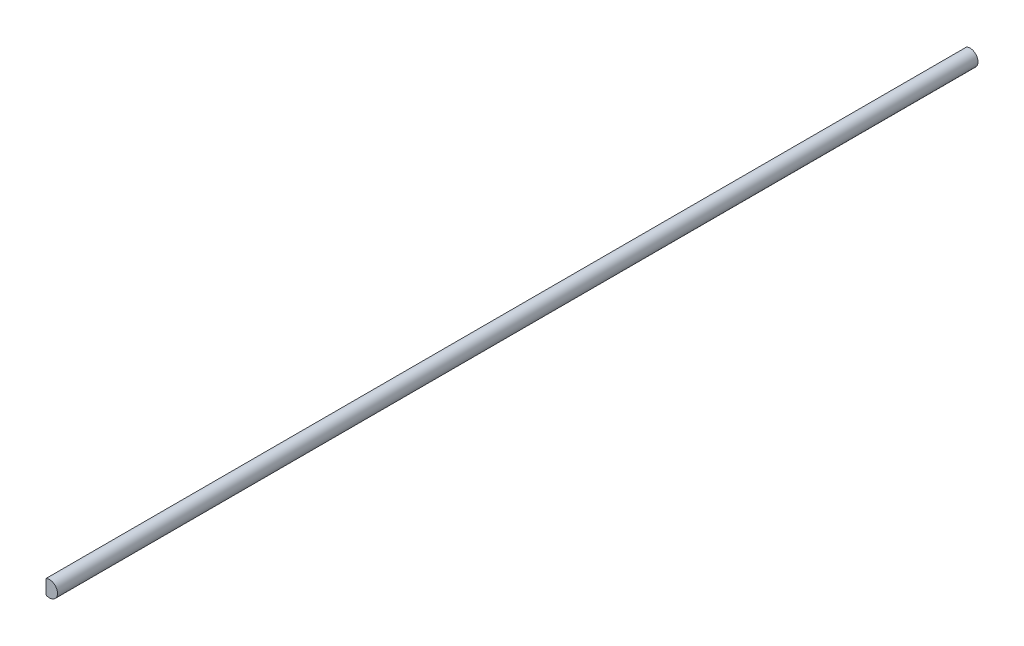
ISO-10303-21;
HEADER;
FILE_DESCRIPTION(('STEP AP214'),'2;1');
FILE_NAME('part.step','',(''),(''),'','','');
FILE_SCHEMA(('AUTOMOTIVE_DESIGN { 1 0 10303 214 1 1 1 1 }'));
ENDSEC;
DATA;
#1=APPLICATION_CONTEXT('core data for automotive mechanical design processes');
#2=APPLICATION_PROTOCOL_DEFINITION('international standard','automotive_design',2000,#1);
#3=PRODUCT_CONTEXT('',#1,'mechanical');
#4=PRODUCT('Part','Part','',(#3));
#5=PRODUCT_RELATED_PRODUCT_CATEGORY('part','',(#4));
#6=PRODUCT_DEFINITION_FORMATION('','',#4);
#7=PRODUCT_DEFINITION_CONTEXT('part definition',#1,'design');
#8=PRODUCT_DEFINITION('design','',#6,#7);
#9=PRODUCT_DEFINITION_SHAPE('','',#8);
#10=(LENGTH_UNIT() NAMED_UNIT(*) SI_UNIT(.MILLI.,.METRE.));
#11=(NAMED_UNIT(*) PLANE_ANGLE_UNIT() SI_UNIT($,.RADIAN.));
#12=(NAMED_UNIT(*) SI_UNIT($,.STERADIAN.) SOLID_ANGLE_UNIT());
#13=UNCERTAINTY_MEASURE_WITH_UNIT(LENGTH_MEASURE(1.E-05),#10,'distance_accuracy_value','');
#14=(GEOMETRIC_REPRESENTATION_CONTEXT(3) GLOBAL_UNCERTAINTY_ASSIGNED_CONTEXT((#13)) GLOBAL_UNIT_ASSIGNED_CONTEXT((#10,
#11,#12)) REPRESENTATION_CONTEXT('',''));
#15=CARTESIAN_POINT('',(0.,0.,0.));
#16=DIRECTION('',(0.,0.,1.));
#17=DIRECTION('',(1.,0.,0.));
#18=AXIS2_PLACEMENT_3D('',#15,#16,#17);
#19=CARTESIAN_POINT('',(0.,0.,130.));
#20=DIRECTION('',(0.,0.,-1.));
#21=DIRECTION('',(-1.,0.,0.));
#22=AXIS2_PLACEMENT_3D('',#19,#20,#21);
#23=CYLINDRICAL_SURFACE('',#22,2.25);
#24=CARTESIAN_POINT('',(0.,0.,-130.));
#25=DIRECTION('',(0.,0.,1.));
#26=DIRECTION('',(1.,0.,0.));
#27=AXIS2_PLACEMENT_3D('',#24,#25,#26);
#28=CIRCLE('',#27,2.25);
#29=CARTESIAN_POINT('',(-0.99,-2.02049498885793,-130.));
#30=VERTEX_POINT('',#29);
#31=CARTESIAN_POINT('',(-0.99,2.02049498885793,-130.));
#32=VERTEX_POINT('',#31);
#33=EDGE_CURVE('E69',#30,#32,#28,.T.);
#34=ORIENTED_EDGE('',*,*,#33,.T.);
#35=DIRECTION('',(0.,0.,-1.));
#36=VECTOR('',#35,1.);
#37=CARTESIAN_POINT('',(-0.99,2.02049498885793,130.));
#38=LINE('',#37,#36);
#39=CARTESIAN_POINT('',(-0.99,2.02049498885793,130.));
#40=VERTEX_POINT('',#39);
#41=EDGE_CURVE('E11',#40,#32,#38,.T.);
#42=ORIENTED_EDGE('',*,*,#41,.F.);
#43=CARTESIAN_POINT('',(0.,0.,130.));
#44=DIRECTION('',(0.,0.,1.));
#45=DIRECTION('',(1.,0.,0.));
#46=AXIS2_PLACEMENT_3D('',#43,#44,#45);
#47=CIRCLE('',#46,2.25);
#48=CARTESIAN_POINT('',(-0.99,-2.02049498885793,130.));
#49=VERTEX_POINT('',#48);
#50=EDGE_CURVE('E68',#49,#40,#47,.T.);
#51=ORIENTED_EDGE('',*,*,#50,.F.);
#52=DIRECTION('',(0.,0.,-1.));
#53=VECTOR('',#52,1.);
#54=CARTESIAN_POINT('',(-0.99,-2.02049498885793,130.));
#55=LINE('',#54,#53);
#56=EDGE_CURVE('E46',#49,#30,#55,.T.);
#57=ORIENTED_EDGE('',*,*,#56,.T.);
#58=EDGE_LOOP('',(#34,#42,#51,#57));
#59=FACE_BOUND('',#58,.T.);
#60=ADVANCED_FACE('F38',(#59),#23,.T.);
#61=CARTESIAN_POINT('',(-0.99,2.02049498885793,130.));
#62=DIRECTION('',(1.,0.,0.));
#63=DIRECTION('',(0.,0.,-1.));
#64=AXIS2_PLACEMENT_3D('',#61,#62,#63);
#65=PLANE('',#64);
#66=DIRECTION('',(0.,-1.,0.));
#67=VECTOR('',#66,1.);
#68=CARTESIAN_POINT('',(-0.99,2.02049498885793,-130.));
#69=LINE('',#68,#67);
#70=EDGE_CURVE('E61',#32,#30,#69,.T.);
#71=ORIENTED_EDGE('',*,*,#70,.T.);
#72=ORIENTED_EDGE('',*,*,#56,.F.);
#73=DIRECTION('',(0.,-1.,0.));
#74=VECTOR('',#73,1.);
#75=CARTESIAN_POINT('',(-0.99,2.02049498885793,130.));
#76=LINE('',#75,#74);
#77=EDGE_CURVE('E53',#40,#49,#76,.T.);
#78=ORIENTED_EDGE('',*,*,#77,.F.);
#79=ORIENTED_EDGE('',*,*,#41,.T.);
#80=EDGE_LOOP('',(#71,#72,#78,#79));
#81=FACE_BOUND('',#80,.T.);
#82=ADVANCED_FACE('F64',(#81),#65,.F.);
#83=CARTESIAN_POINT('',(0.,0.,130.));
#84=DIRECTION('',(0.,0.,1.));
#85=DIRECTION('',(1.,0.,0.));
#86=AXIS2_PLACEMENT_3D('',#83,#84,#85);
#87=PLANE('',#86);
#88=ORIENTED_EDGE('',*,*,#50,.T.);
#89=ORIENTED_EDGE('',*,*,#77,.T.);
#90=EDGE_LOOP('',(#88,#89));
#91=FACE_BOUND('',#90,.T.);
#92=ADVANCED_FACE('F76',(#91),#87,.T.);
#93=CARTESIAN_POINT('',(0.,0.,-130.));
#94=DIRECTION('',(0.,0.,1.));
#95=DIRECTION('',(1.,0.,0.));
#96=AXIS2_PLACEMENT_3D('',#93,#94,#95);
#97=PLANE('',#96);
#98=ORIENTED_EDGE('',*,*,#33,.F.);
#99=ORIENTED_EDGE('',*,*,#70,.F.);
#100=EDGE_LOOP('',(#98,#99));
#101=FACE_BOUND('',#100,.T.);
#102=ADVANCED_FACE('F72',(#101),#97,.F.);
#103=CLOSED_SHELL('',(#60,#82,#92,#102));
#104=MANIFOLD_SOLID_BREP('B2',#103);
#105=ADVANCED_BREP_SHAPE_REPRESENTATION('',(#18,#104),#14);
#106=SHAPE_DEFINITION_REPRESENTATION(#9,#105);
ENDSEC;
END-ISO-10303-21;
